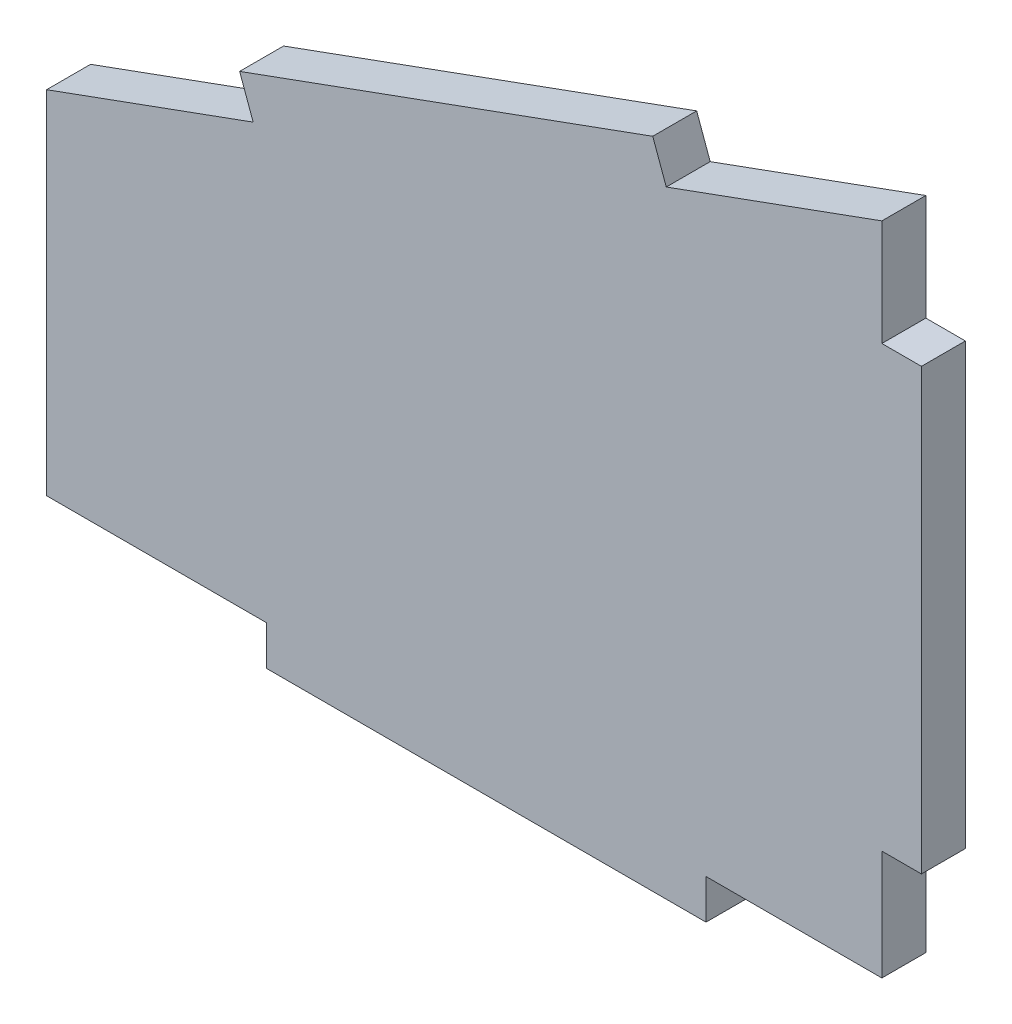
ISO-10303-21;
HEADER;
FILE_DESCRIPTION(('STEP AP214'),'2;1');
FILE_NAME('part.step','',(''),(''),'','','');
FILE_SCHEMA(('AUTOMOTIVE_DESIGN { 1 0 10303 214 1 1 1 1 }'));
ENDSEC;
DATA;
#1=APPLICATION_CONTEXT('core data for automotive mechanical design processes');
#2=APPLICATION_PROTOCOL_DEFINITION('international standard','automotive_design',2000,#1);
#3=PRODUCT_CONTEXT('',#1,'mechanical');
#4=PRODUCT('Part','Part','',(#3));
#5=PRODUCT_RELATED_PRODUCT_CATEGORY('part','',(#4));
#6=PRODUCT_DEFINITION_FORMATION('','',#4);
#7=PRODUCT_DEFINITION_CONTEXT('part definition',#1,'design');
#8=PRODUCT_DEFINITION('design','',#6,#7);
#9=PRODUCT_DEFINITION_SHAPE('','',#8);
#10=(LENGTH_UNIT() NAMED_UNIT(*) SI_UNIT(.MILLI.,.METRE.));
#11=(NAMED_UNIT(*) PLANE_ANGLE_UNIT() SI_UNIT($,.RADIAN.));
#12=(NAMED_UNIT(*) SI_UNIT($,.STERADIAN.) SOLID_ANGLE_UNIT());
#13=UNCERTAINTY_MEASURE_WITH_UNIT(LENGTH_MEASURE(1.E-05),#10,'distance_accuracy_value','');
#14=(GEOMETRIC_REPRESENTATION_CONTEXT(3) GLOBAL_UNCERTAINTY_ASSIGNED_CONTEXT((#13)) GLOBAL_UNIT_ASSIGNED_CONTEXT((#10,
#11,#12)) REPRESENTATION_CONTEXT('',''));
#15=CARTESIAN_POINT('',(0.,0.,0.));
#16=DIRECTION('',(0.,0.,1.));
#17=DIRECTION('',(1.,0.,0.));
#18=AXIS2_PLACEMENT_3D('',#15,#16,#17);
#19=CARTESIAN_POINT('',(99.5,-27.51,-0.01));
#20=DIRECTION('',(1.,0.,0.));
#21=DIRECTION('',(0.,1.,0.));
#22=AXIS2_PLACEMENT_3D('',#19,#20,#21);
#23=PLANE('',#22);
#24=DIRECTION('',(0.,1.,0.));
#25=VECTOR('',#24,1.);
#26=CARTESIAN_POINT('',(99.5,-4.9614138723554,5.));
#27=LINE('',#26,#25);
#28=CARTESIAN_POINT('',(99.5,-27.5,5.));
#29=VERTEX_POINT('',#28);
#30=CARTESIAN_POINT('',(99.5,22.5,5.));
#31=VERTEX_POINT('',#30);
#32=EDGE_CURVE('E266',#29,#31,#27,.T.);
#33=ORIENTED_EDGE('',*,*,#32,.F.);
#34=DIRECTION('',(0.,0.,1.));
#35=VECTOR('',#34,1.);
#36=CARTESIAN_POINT('',(99.5,-27.5,2.5));
#37=LINE('',#36,#35);
#38=CARTESIAN_POINT('',(99.5,-27.5,0.));
#39=VERTEX_POINT('',#38);
#40=EDGE_CURVE('E272',#39,#29,#37,.T.);
#41=ORIENTED_EDGE('',*,*,#40,.F.);
#42=DIRECTION('',(0.,-1.,0.));
#43=VECTOR('',#42,1.);
#44=CARTESIAN_POINT('',(99.5,-4.9614138723554,0.));
#45=LINE('',#44,#43);
#46=CARTESIAN_POINT('',(99.5,22.5,0.));
#47=VERTEX_POINT('',#46);
#48=EDGE_CURVE('E223',#47,#39,#45,.T.);
#49=ORIENTED_EDGE('',*,*,#48,.F.);
#50=DIRECTION('',(0.,0.,-1.));
#51=VECTOR('',#50,1.);
#52=CARTESIAN_POINT('',(99.5,22.5,2.5));
#53=LINE('',#52,#51);
#54=EDGE_CURVE('E219',#31,#47,#53,.T.);
#55=ORIENTED_EDGE('',*,*,#54,.F.);
#56=EDGE_LOOP('',(#33,#41,#49,#55));
#57=FACE_BOUND('',#56,.T.);
#58=ADVANCED_FACE('F16',(#57),#23,.T.);
#59=CARTESIAN_POINT('',(99.51,22.5,-0.01));
#60=DIRECTION('',(0.,1.,0.));
#61=DIRECTION('',(-1.,0.,0.));
#62=AXIS2_PLACEMENT_3D('',#59,#60,#61);
#63=PLANE('',#62);
#64=DIRECTION('',(-1.,0.,0.));
#65=VECTOR('',#64,1.);
#66=CARTESIAN_POINT('',(49.75,22.5,5.));
#67=LINE('',#66,#65);
#68=CARTESIAN_POINT('',(95.,22.5,5.));
#69=VERTEX_POINT('',#68);
#70=EDGE_CURVE('E179',#31,#69,#67,.T.);
#71=ORIENTED_EDGE('',*,*,#70,.F.);
#72=ORIENTED_EDGE('',*,*,#54,.T.);
#73=DIRECTION('',(1.,0.,0.));
#74=VECTOR('',#73,1.);
#75=CARTESIAN_POINT('',(49.75,22.5,0.));
#76=LINE('',#75,#74);
#77=CARTESIAN_POINT('',(95.,22.5,0.));
#78=VERTEX_POINT('',#77);
#79=EDGE_CURVE('E173',#78,#47,#76,.T.);
#80=ORIENTED_EDGE('',*,*,#79,.F.);
#81=DIRECTION('',(0.,0.,-1.));
#82=VECTOR('',#81,1.);
#83=CARTESIAN_POINT('',(95.,22.5,2.5));
#84=LINE('',#83,#82);
#85=EDGE_CURVE('E169',#69,#78,#84,.T.);
#86=ORIENTED_EDGE('',*,*,#85,.F.);
#87=EDGE_LOOP('',(#71,#72,#80,#86));
#88=FACE_BOUND('',#87,.T.);
#89=ADVANCED_FACE('F221',(#88),#63,.T.);
#90=CARTESIAN_POINT('',(95.,22.49,-0.01));
#91=DIRECTION('',(1.,0.,0.));
#92=DIRECTION('',(0.,1.,0.));
#93=AXIS2_PLACEMENT_3D('',#90,#91,#92);
#94=PLANE('',#93);
#95=DIRECTION('',(0.,1.,0.));
#96=VECTOR('',#95,1.);
#97=CARTESIAN_POINT('',(95.,-4.9614138723554,5.));
#98=LINE('',#97,#96);
#99=CARTESIAN_POINT('',(95.,34.5771722552892,5.));
#100=VERTEX_POINT('',#99);
#101=EDGE_CURVE('E175',#69,#100,#98,.T.);
#102=ORIENTED_EDGE('',*,*,#101,.F.);
#103=ORIENTED_EDGE('',*,*,#85,.T.);
#104=DIRECTION('',(0.,-1.,0.));
#105=VECTOR('',#104,1.);
#106=CARTESIAN_POINT('',(95.,-4.9614138723554,0.));
#107=LINE('',#106,#105);
#108=CARTESIAN_POINT('',(95.,34.5771722552892,0.));
#109=VERTEX_POINT('',#108);
#110=EDGE_CURVE('E170',#109,#78,#107,.T.);
#111=ORIENTED_EDGE('',*,*,#110,.F.);
#112=DIRECTION('',(0.,0.,-1.));
#113=VECTOR('',#112,1.);
#114=CARTESIAN_POINT('',(95.,34.5771722552892,2.5));
#115=LINE('',#114,#113);
#116=EDGE_CURVE('E167',#100,#109,#115,.T.);
#117=ORIENTED_EDGE('',*,*,#116,.F.);
#118=EDGE_LOOP('',(#102,#103,#111,#117));
#119=FACE_BOUND('',#118,.T.);
#120=ADVANCED_FACE('F215',(#119),#94,.T.);
#121=CARTESIAN_POINT('',(95.0093969262079,34.5805924567225,-0.01));
#122=DIRECTION('',(-0.342020143325668,0.939692620785909,0.));
#123=DIRECTION('',(-0.939692620785909,-0.342020143325668,0.));
#124=AXIS2_PLACEMENT_3D('',#121,#122,#123);
#125=PLANE('',#124);
#126=DIRECTION('',(-0.939692620785908,-0.34202014332567,0.));
#127=VECTOR('',#126,1.);
#128=CARTESIAN_POINT('',(95.,34.5771722552892,5.));
#129=LINE('',#128,#127);
#130=CARTESIAN_POINT('',(70.4769465589431,25.6515107494251,5.));
#131=VERTEX_POINT('',#130);
#132=EDGE_CURVE('E178',#100,#131,#129,.T.);
#133=ORIENTED_EDGE('',*,*,#132,.F.);
#134=ORIENTED_EDGE('',*,*,#116,.T.);
#135=DIRECTION('',(0.939692620785908,0.34202014332567,0.));
#136=VECTOR('',#135,1.);
#137=CARTESIAN_POINT('',(70.4769465589431,25.6515107494251,0.));
#138=LINE('',#137,#136);
#139=CARTESIAN_POINT('',(70.4769465589431,25.6515107494251,0.));
#140=VERTEX_POINT('',#139);
#141=EDGE_CURVE('E174',#140,#109,#138,.T.);
#142=ORIENTED_EDGE('',*,*,#141,.F.);
#143=DIRECTION('',(0.,0.,-1.));
#144=VECTOR('',#143,1.);
#145=CARTESIAN_POINT('',(70.4769465589431,25.6515107494251,2.5));
#146=LINE('',#145,#144);
#147=EDGE_CURVE('E165',#131,#140,#146,.T.);
#148=ORIENTED_EDGE('',*,*,#147,.F.);
#149=EDGE_LOOP('',(#133,#134,#142,#148));
#150=FACE_BOUND('',#149,.T.);
#151=ADVANCED_FACE('F210',(#150),#125,.T.);
#152=CARTESIAN_POINT('',(70.4803667603763,25.6421138232173,-0.01));
#153=DIRECTION('',(0.939692620785908,0.342020143325671,0.));
#154=DIRECTION('',(-0.342020143325671,0.939692620785908,0.));
#155=AXIS2_PLACEMENT_3D('',#152,#153,#154);
#156=PLANE('',#155);
#157=DIRECTION('',(-0.342020143325658,0.939692620785912,0.));
#158=VECTOR('',#157,1.);
#159=CARTESIAN_POINT('',(70.4769465589431,25.6515107494251,5.));
#160=LINE('',#159,#158);
#161=CARTESIAN_POINT('',(68.9378559139776,29.8801275429617,5.));
#162=VERTEX_POINT('',#161);
#163=EDGE_CURVE('E190',#131,#162,#160,.T.);
#164=ORIENTED_EDGE('',*,*,#163,.F.);
#165=ORIENTED_EDGE('',*,*,#147,.T.);
#166=DIRECTION('',(0.342020143325658,-0.939692620785912,0.));
#167=VECTOR('',#166,1.);
#168=CARTESIAN_POINT('',(68.9378559139776,29.8801275429617,0.));
#169=LINE('',#168,#167);
#170=CARTESIAN_POINT('',(68.9378559139776,29.8801275429617,0.));
#171=VERTEX_POINT('',#170);
#172=EDGE_CURVE('E197',#171,#140,#169,.T.);
#173=ORIENTED_EDGE('',*,*,#172,.F.);
#174=DIRECTION('',(0.,0.,-1.));
#175=VECTOR('',#174,1.);
#176=CARTESIAN_POINT('',(68.9378559139776,29.8801275429617,2.5));
#177=LINE('',#176,#175);
#178=EDGE_CURVE('E163',#162,#171,#177,.T.);
#179=ORIENTED_EDGE('',*,*,#178,.F.);
#180=EDGE_LOOP('',(#164,#165,#173,#179));
#181=FACE_BOUND('',#180,.T.);
#182=ADVANCED_FACE('F206',(#181),#156,.T.);
#183=CARTESIAN_POINT('',(68.9472528401855,29.883547744395,-0.01));
#184=DIRECTION('',(-0.342020143325669,0.939692620785908,0.));
#185=DIRECTION('',(-0.939692620785908,-0.342020143325669,0.));
#186=AXIS2_PLACEMENT_3D('',#183,#184,#185);
#187=PLANE('',#186);
#188=DIRECTION('',(-0.939692620785909,-0.342020143325668,0.));
#189=VECTOR('',#188,1.);
#190=CARTESIAN_POINT('',(68.9378559139776,29.8801275429617,5.));
#191=LINE('',#190,#189);
#192=CARTESIAN_POINT('',(21.9532248746822,12.7791203766783,5.));
#193=VERTEX_POINT('',#192);
#194=EDGE_CURVE('E187',#162,#193,#191,.T.);
#195=ORIENTED_EDGE('',*,*,#194,.F.);
#196=ORIENTED_EDGE('',*,*,#178,.T.);
#197=DIRECTION('',(0.939692620785909,0.342020143325668,0.));
#198=VECTOR('',#197,1.);
#199=CARTESIAN_POINT('',(21.9532248746822,12.7791203766783,0.));
#200=LINE('',#199,#198);
#201=CARTESIAN_POINT('',(21.9532248746822,12.7791203766783,0.));
#202=VERTEX_POINT('',#201);
#203=EDGE_CURVE('E150',#202,#171,#200,.T.);
#204=ORIENTED_EDGE('',*,*,#203,.F.);
#205=DIRECTION('',(0.,0.,-1.));
#206=VECTOR('',#205,1.);
#207=CARTESIAN_POINT('',(21.9532248746822,12.7791203766783,2.5));
#208=LINE('',#207,#206);
#209=EDGE_CURVE('E142',#193,#202,#208,.T.);
#210=ORIENTED_EDGE('',*,*,#209,.F.);
#211=EDGE_LOOP('',(#195,#196,#204,#210));
#212=FACE_BOUND('',#211,.T.);
#213=ADVANCED_FACE('F203',(#212),#187,.T.);
#214=CARTESIAN_POINT('',(21.9498046732489,12.7885173028862,-0.01));
#215=DIRECTION('',(-0.939692620785904,-0.342020143325682,0.));
#216=DIRECTION('',(0.342020143325682,-0.939692620785904,0.));
#217=AXIS2_PLACEMENT_3D('',#214,#215,#216);
#218=PLANE('',#217);
#219=DIRECTION('',(0.342020143325667,-0.939692620785909,0.));
#220=VECTOR('',#219,1.);
#221=CARTESIAN_POINT('',(21.9532248746822,12.7791203766783,5.));
#222=LINE('',#221,#220);
#223=CARTESIAN_POINT('',(23.4923155196477,8.55050358314172,5.));
#224=VERTEX_POINT('',#223);
#225=EDGE_CURVE('E185',#193,#224,#222,.T.);
#226=ORIENTED_EDGE('',*,*,#225,.F.);
#227=ORIENTED_EDGE('',*,*,#209,.T.);
#228=DIRECTION('',(-0.342020143325666,0.93969262078591,0.));
#229=VECTOR('',#228,1.);
#230=CARTESIAN_POINT('',(23.4923155196477,8.55050358314173,0.));
#231=LINE('',#230,#229);
#232=CARTESIAN_POINT('',(23.4923155196477,8.55050358314172,0.));
#233=VERTEX_POINT('',#232);
#234=EDGE_CURVE('E145',#233,#202,#231,.T.);
#235=ORIENTED_EDGE('',*,*,#234,.F.);
#236=DIRECTION('',(0.,0.,-1.));
#237=VECTOR('',#236,1.);
#238=CARTESIAN_POINT('',(23.4923155196477,8.55050358314171,2.5));
#239=LINE('',#238,#237);
#240=EDGE_CURVE('E132',#224,#233,#239,.T.);
#241=ORIENTED_EDGE('',*,*,#240,.F.);
#242=EDGE_LOOP('',(#226,#227,#235,#241));
#243=FACE_BOUND('',#242,.T.);
#244=ADVANCED_FACE('F146',(#243),#218,.T.);
#245=CARTESIAN_POINT('',(23.5017124458556,8.55392378457498,-0.01));
#246=DIRECTION('',(-0.342020143325668,0.939692620785908,0.));
#247=DIRECTION('',(-0.939692620785908,-0.342020143325668,0.));
#248=AXIS2_PLACEMENT_3D('',#245,#246,#247);
#249=PLANE('',#248);
#250=DIRECTION('',(-0.939692620785908,-0.34202014332567,0.));
#251=VECTOR('',#250,1.);
#252=CARTESIAN_POINT('',(23.4923155196477,8.55050358314173,5.));
#253=LINE('',#252,#251);
#254=CARTESIAN_POINT('',(0.,0.,5.));
#255=VERTEX_POINT('',#254);
#256=EDGE_CURVE('E138',#224,#255,#253,.T.);
#257=ORIENTED_EDGE('',*,*,#256,.F.);
#258=ORIENTED_EDGE('',*,*,#240,.T.);
#259=DIRECTION('',(0.939692620785908,0.342020143325669,0.));
#260=VECTOR('',#259,1.);
#261=CARTESIAN_POINT('',(0.,0.,0.));
#262=LINE('',#261,#260);
#263=CARTESIAN_POINT('',(0.,0.,0.));
#264=VERTEX_POINT('',#263);
#265=EDGE_CURVE('E20',#264,#233,#262,.T.);
#266=ORIENTED_EDGE('',*,*,#265,.F.);
#267=DIRECTION('',(0.,0.,-1.));
#268=VECTOR('',#267,1.);
#269=CARTESIAN_POINT('',(0.,0.,2.5));
#270=LINE('',#269,#268);
#271=EDGE_CURVE('E127',#255,#264,#270,.T.);
#272=ORIENTED_EDGE('',*,*,#271,.F.);
#273=EDGE_LOOP('',(#257,#258,#266,#272));
#274=FACE_BOUND('',#273,.T.);
#275=ADVANCED_FACE('F134',(#274),#249,.T.);
#276=CARTESIAN_POINT('',(0.,0.01,-0.01));
#277=DIRECTION('',(-1.,0.,0.));
#278=DIRECTION('',(0.,-1.,0.));
#279=AXIS2_PLACEMENT_3D('',#276,#277,#278);
#280=PLANE('',#279);
#281=DIRECTION('',(0.,-1.,0.));
#282=VECTOR('',#281,1.);
#283=CARTESIAN_POINT('',(0.,-4.9614138723554,5.));
#284=LINE('',#283,#282);
#285=CARTESIAN_POINT('',(0.,-40.,5.));
#286=VERTEX_POINT('',#285);
#287=EDGE_CURVE('E180',#255,#286,#284,.T.);
#288=ORIENTED_EDGE('',*,*,#287,.F.);
#289=ORIENTED_EDGE('',*,*,#271,.T.);
#290=DIRECTION('',(0.,1.,0.));
#291=VECTOR('',#290,1.);
#292=CARTESIAN_POINT('',(0.,-4.9614138723554,0.));
#293=LINE('',#292,#291);
#294=CARTESIAN_POINT('',(0.,-40.,0.));
#295=VERTEX_POINT('',#294);
#296=EDGE_CURVE('E154',#295,#264,#293,.T.);
#297=ORIENTED_EDGE('',*,*,#296,.F.);
#298=DIRECTION('',(0.,0.,-1.));
#299=VECTOR('',#298,1.);
#300=CARTESIAN_POINT('',(0.,-40.,2.5));
#301=LINE('',#300,#299);
#302=EDGE_CURVE('E243',#286,#295,#301,.T.);
#303=ORIENTED_EDGE('',*,*,#302,.F.);
#304=EDGE_LOOP('',(#288,#289,#297,#303));
#305=FACE_BOUND('',#304,.T.);
#306=ADVANCED_FACE('F249',(#305),#280,.T.);
#307=CARTESIAN_POINT('',(-0.01,-40.,-0.01));
#308=DIRECTION('',(0.,-1.,0.));
#309=DIRECTION('',(1.,0.,0.));
#310=AXIS2_PLACEMENT_3D('',#307,#308,#309);
#311=PLANE('',#310);
#312=DIRECTION('',(1.,0.,0.));
#313=VECTOR('',#312,1.);
#314=CARTESIAN_POINT('',(49.75,-40.,5.));
#315=LINE('',#314,#313);
#316=CARTESIAN_POINT('',(25.,-40.,5.));
#317=VERTEX_POINT('',#316);
#318=EDGE_CURVE('E183',#286,#317,#315,.T.);
#319=ORIENTED_EDGE('',*,*,#318,.F.);
#320=ORIENTED_EDGE('',*,*,#302,.T.);
#321=DIRECTION('',(-1.,0.,0.));
#322=VECTOR('',#321,1.);
#323=CARTESIAN_POINT('',(49.75,-40.,0.));
#324=LINE('',#323,#322);
#325=CARTESIAN_POINT('',(25.,-40.,0.));
#326=VERTEX_POINT('',#325);
#327=EDGE_CURVE('E155',#326,#295,#324,.T.);
#328=ORIENTED_EDGE('',*,*,#327,.F.);
#329=DIRECTION('',(0.,0.,-1.));
#330=VECTOR('',#329,1.);
#331=CARTESIAN_POINT('',(25.,-40.,2.5));
#332=LINE('',#331,#330);
#333=EDGE_CURVE('E241',#317,#326,#332,.T.);
#334=ORIENTED_EDGE('',*,*,#333,.F.);
#335=EDGE_LOOP('',(#319,#320,#328,#334));
#336=FACE_BOUND('',#335,.T.);
#337=ADVANCED_FACE('F247',(#336),#311,.T.);
#338=CARTESIAN_POINT('',(25.,-39.99,-0.01));
#339=DIRECTION('',(-1.,0.,0.));
#340=DIRECTION('',(0.,-1.,0.));
#341=AXIS2_PLACEMENT_3D('',#338,#339,#340);
#342=PLANE('',#341);
#343=DIRECTION('',(0.,-1.,0.));
#344=VECTOR('',#343,1.);
#345=CARTESIAN_POINT('',(25.,-4.9614138723554,5.));
#346=LINE('',#345,#344);
#347=CARTESIAN_POINT('',(25.,-44.5,5.));
#348=VERTEX_POINT('',#347);
#349=EDGE_CURVE('E257',#317,#348,#346,.T.);
#350=ORIENTED_EDGE('',*,*,#349,.F.);
#351=ORIENTED_EDGE('',*,*,#333,.T.);
#352=DIRECTION('',(0.,1.,0.));
#353=VECTOR('',#352,1.);
#354=CARTESIAN_POINT('',(25.,-4.9614138723554,0.));
#355=LINE('',#354,#353);
#356=CARTESIAN_POINT('',(25.,-44.5,0.));
#357=VERTEX_POINT('',#356);
#358=EDGE_CURVE('E157',#357,#326,#355,.T.);
#359=ORIENTED_EDGE('',*,*,#358,.F.);
#360=DIRECTION('',(0.,0.,-1.));
#361=VECTOR('',#360,1.);
#362=CARTESIAN_POINT('',(25.,-44.5,2.5));
#363=LINE('',#362,#361);
#364=EDGE_CURVE('E239',#348,#357,#363,.T.);
#365=ORIENTED_EDGE('',*,*,#364,.F.);
#366=EDGE_LOOP('',(#350,#351,#359,#365));
#367=FACE_BOUND('',#366,.T.);
#368=ADVANCED_FACE('F254',(#367),#342,.T.);
#369=CARTESIAN_POINT('',(24.99,-44.5,-0.01));
#370=DIRECTION('',(0.,-1.,0.));
#371=DIRECTION('',(1.,0.,0.));
#372=AXIS2_PLACEMENT_3D('',#369,#370,#371);
#373=PLANE('',#372);
#374=DIRECTION('',(1.,0.,0.));
#375=VECTOR('',#374,1.);
#376=CARTESIAN_POINT('',(49.75,-44.5,5.));
#377=LINE('',#376,#375);
#378=CARTESIAN_POINT('',(75.,-44.5,5.));
#379=VERTEX_POINT('',#378);
#380=EDGE_CURVE('E259',#348,#379,#377,.T.);
#381=ORIENTED_EDGE('',*,*,#380,.F.);
#382=ORIENTED_EDGE('',*,*,#364,.T.);
#383=DIRECTION('',(-1.,0.,0.));
#384=VECTOR('',#383,1.);
#385=CARTESIAN_POINT('',(49.75,-44.5,0.));
#386=LINE('',#385,#384);
#387=CARTESIAN_POINT('',(75.,-44.5,0.));
#388=VERTEX_POINT('',#387);
#389=EDGE_CURVE('E231',#388,#357,#386,.T.);
#390=ORIENTED_EDGE('',*,*,#389,.F.);
#391=DIRECTION('',(0.,0.,-1.));
#392=VECTOR('',#391,1.);
#393=CARTESIAN_POINT('',(75.,-44.5,2.5));
#394=LINE('',#393,#392);
#395=EDGE_CURVE('E237',#379,#388,#394,.T.);
#396=ORIENTED_EDGE('',*,*,#395,.F.);
#397=EDGE_LOOP('',(#381,#382,#390,#396));
#398=FACE_BOUND('',#397,.T.);
#399=ADVANCED_FACE('F302',(#398),#373,.T.);
#400=CARTESIAN_POINT('',(75.,-44.51,-0.01));
#401=DIRECTION('',(1.,0.,0.));
#402=DIRECTION('',(0.,1.,0.));
#403=AXIS2_PLACEMENT_3D('',#400,#401,#402);
#404=PLANE('',#403);
#405=DIRECTION('',(0.,1.,0.));
#406=VECTOR('',#405,1.);
#407=CARTESIAN_POINT('',(75.,-4.9614138723554,5.));
#408=LINE('',#407,#406);
#409=CARTESIAN_POINT('',(75.,-40.,5.));
#410=VERTEX_POINT('',#409);
#411=EDGE_CURVE('E298',#379,#410,#408,.T.);
#412=ORIENTED_EDGE('',*,*,#411,.F.);
#413=ORIENTED_EDGE('',*,*,#395,.T.);
#414=DIRECTION('',(0.,-1.,0.));
#415=VECTOR('',#414,1.);
#416=CARTESIAN_POINT('',(75.,-4.9614138723554,0.));
#417=LINE('',#416,#415);
#418=CARTESIAN_POINT('',(75.,-40.,0.));
#419=VERTEX_POINT('',#418);
#420=EDGE_CURVE('E234',#419,#388,#417,.T.);
#421=ORIENTED_EDGE('',*,*,#420,.F.);
#422=DIRECTION('',(0.,0.,-1.));
#423=VECTOR('',#422,1.);
#424=CARTESIAN_POINT('',(75.,-40.,2.5));
#425=LINE('',#424,#423);
#426=EDGE_CURVE('E290',#410,#419,#425,.T.);
#427=ORIENTED_EDGE('',*,*,#426,.F.);
#428=EDGE_LOOP('',(#412,#413,#421,#427));
#429=FACE_BOUND('',#428,.T.);
#430=ADVANCED_FACE('F304',(#429),#404,.T.);
#431=CARTESIAN_POINT('',(99.51,-44.51,0.));
#432=DIRECTION('',(0.,0.,-1.));
#433=DIRECTION('',(-1.,0.,0.));
#434=AXIS2_PLACEMENT_3D('',#431,#432,#433);
#435=PLANE('',#434);
#436=ORIENTED_EDGE('',*,*,#79,.T.);
#437=ORIENTED_EDGE('',*,*,#48,.T.);
#438=DIRECTION('',(1.,0.,0.));
#439=VECTOR('',#438,1.);
#440=CARTESIAN_POINT('',(97.25,-27.5,0.));
#441=LINE('',#440,#439);
#442=CARTESIAN_POINT('',(95.,-27.5,0.));
#443=VERTEX_POINT('',#442);
#444=EDGE_CURVE('E225',#443,#39,#441,.T.);
#445=ORIENTED_EDGE('',*,*,#444,.F.);
#446=DIRECTION('',(0.,1.,0.));
#447=VECTOR('',#446,1.);
#448=CARTESIAN_POINT('',(95.,-33.75,0.));
#449=LINE('',#448,#447);
#450=CARTESIAN_POINT('',(95.,-40.,0.));
#451=VERTEX_POINT('',#450);
#452=EDGE_CURVE('E283',#451,#443,#449,.T.);
#453=ORIENTED_EDGE('',*,*,#452,.F.);
#454=DIRECTION('',(1.,0.,0.));
#455=VECTOR('',#454,1.);
#456=CARTESIAN_POINT('',(85.,-40.,0.));
#457=LINE('',#456,#455);
#458=EDGE_CURVE('E296',#419,#451,#457,.T.);
#459=ORIENTED_EDGE('',*,*,#458,.F.);
#460=ORIENTED_EDGE('',*,*,#420,.T.);
#461=ORIENTED_EDGE('',*,*,#389,.T.);
#462=ORIENTED_EDGE('',*,*,#358,.T.);
#463=ORIENTED_EDGE('',*,*,#327,.T.);
#464=ORIENTED_EDGE('',*,*,#296,.T.);
#465=ORIENTED_EDGE('',*,*,#265,.T.);
#466=ORIENTED_EDGE('',*,*,#234,.T.);
#467=ORIENTED_EDGE('',*,*,#203,.T.);
#468=ORIENTED_EDGE('',*,*,#172,.T.);
#469=ORIENTED_EDGE('',*,*,#141,.T.);
#470=ORIENTED_EDGE('',*,*,#110,.T.);
#471=EDGE_LOOP('',(#436,#437,#445,#453,#459,#460,#461,#462,#463,#464,#465,#466,#467,#468,#469,#470));
#472=FACE_BOUND('',#471,.T.);
#473=ADVANCED_FACE('F152',(#472),#435,.T.);
#474=CARTESIAN_POINT('',(94.99,-27.5,-0.01));
#475=DIRECTION('',(0.,-1.,0.));
#476=DIRECTION('',(1.,0.,0.));
#477=AXIS2_PLACEMENT_3D('',#474,#475,#476);
#478=PLANE('',#477);
#479=DIRECTION('',(1.,0.,0.));
#480=VECTOR('',#479,1.);
#481=CARTESIAN_POINT('',(49.75,-27.5,5.));
#482=LINE('',#481,#480);
#483=CARTESIAN_POINT('',(95.,-27.5,5.));
#484=VERTEX_POINT('',#483);
#485=EDGE_CURVE('E269',#484,#29,#482,.T.);
#486=ORIENTED_EDGE('',*,*,#485,.F.);
#487=DIRECTION('',(0.,0.,1.));
#488=VECTOR('',#487,1.);
#489=CARTESIAN_POINT('',(95.,-27.5,2.5));
#490=LINE('',#489,#488);
#491=EDGE_CURVE('E280',#443,#484,#490,.T.);
#492=ORIENTED_EDGE('',*,*,#491,.F.);
#493=ORIENTED_EDGE('',*,*,#444,.T.);
#494=ORIENTED_EDGE('',*,*,#40,.T.);
#495=EDGE_LOOP('',(#486,#492,#493,#494));
#496=FACE_BOUND('',#495,.T.);
#497=ADVANCED_FACE('F276',(#496),#478,.T.);
#498=CARTESIAN_POINT('',(-0.0100000000000033,-44.51,5.));
#499=DIRECTION('',(0.,0.,1.));
#500=DIRECTION('',(1.,0.,0.));
#501=AXIS2_PLACEMENT_3D('',#498,#499,#500);
#502=PLANE('',#501);
#503=DIRECTION('',(-1.,0.,0.));
#504=VECTOR('',#503,1.);
#505=CARTESIAN_POINT('',(85.,-40.,5.));
#506=LINE('',#505,#504);
#507=CARTESIAN_POINT('',(95.,-40.,5.));
#508=VERTEX_POINT('',#507);
#509=EDGE_CURVE('E35',#508,#410,#506,.T.);
#510=ORIENTED_EDGE('',*,*,#509,.F.);
#511=DIRECTION('',(0.,-1.,0.));
#512=VECTOR('',#511,1.);
#513=CARTESIAN_POINT('',(95.,-33.75,5.));
#514=LINE('',#513,#512);
#515=EDGE_CURVE('E26',#484,#508,#514,.T.);
#516=ORIENTED_EDGE('',*,*,#515,.F.);
#517=ORIENTED_EDGE('',*,*,#485,.T.);
#518=ORIENTED_EDGE('',*,*,#32,.T.);
#519=ORIENTED_EDGE('',*,*,#70,.T.);
#520=ORIENTED_EDGE('',*,*,#101,.T.);
#521=ORIENTED_EDGE('',*,*,#132,.T.);
#522=ORIENTED_EDGE('',*,*,#163,.T.);
#523=ORIENTED_EDGE('',*,*,#194,.T.);
#524=ORIENTED_EDGE('',*,*,#225,.T.);
#525=ORIENTED_EDGE('',*,*,#256,.T.);
#526=ORIENTED_EDGE('',*,*,#287,.T.);
#527=ORIENTED_EDGE('',*,*,#318,.T.);
#528=ORIENTED_EDGE('',*,*,#349,.T.);
#529=ORIENTED_EDGE('',*,*,#380,.T.);
#530=ORIENTED_EDGE('',*,*,#411,.T.);
#531=EDGE_LOOP('',(#510,#516,#517,#518,#519,#520,#521,#522,#523,#524,#525,#526,#527,#528,#529,#530));
#532=FACE_BOUND('',#531,.T.);
#533=ADVANCED_FACE('F261',(#532),#502,.T.);
#534=CARTESIAN_POINT('',(74.99,-40.,-0.01));
#535=DIRECTION('',(0.,-1.,0.));
#536=DIRECTION('',(1.,0.,0.));
#537=AXIS2_PLACEMENT_3D('',#534,#535,#536);
#538=PLANE('',#537);
#539=ORIENTED_EDGE('',*,*,#509,.T.);
#540=ORIENTED_EDGE('',*,*,#426,.T.);
#541=ORIENTED_EDGE('',*,*,#458,.T.);
#542=DIRECTION('',(0.,0.,-1.));
#543=VECTOR('',#542,1.);
#544=CARTESIAN_POINT('',(95.,-40.,2.5));
#545=LINE('',#544,#543);
#546=EDGE_CURVE('E11',#508,#451,#545,.T.);
#547=ORIENTED_EDGE('',*,*,#546,.F.);
#548=EDGE_LOOP('',(#539,#540,#541,#547));
#549=FACE_BOUND('',#548,.T.);
#550=ADVANCED_FACE('F306',(#549),#538,.T.);
#551=CARTESIAN_POINT('',(95.,-40.01,-0.01));
#552=DIRECTION('',(1.,0.,0.));
#553=DIRECTION('',(0.,1.,0.));
#554=AXIS2_PLACEMENT_3D('',#551,#552,#553);
#555=PLANE('',#554);
#556=ORIENTED_EDGE('',*,*,#515,.T.);
#557=ORIENTED_EDGE('',*,*,#546,.T.);
#558=ORIENTED_EDGE('',*,*,#452,.T.);
#559=ORIENTED_EDGE('',*,*,#491,.T.);
#560=EDGE_LOOP('',(#556,#557,#558,#559));
#561=FACE_BOUND('',#560,.T.);
#562=ADVANCED_FACE('F18',(#561),#555,.T.);
#563=CLOSED_SHELL('',(#58,#89,#120,#151,#182,#213,#244,#275,#306,#337,#368,#399,#430,#473,#497,
#533,#550,#562));
#564=MANIFOLD_SOLID_BREP('B1',#563);
#565=ADVANCED_BREP_SHAPE_REPRESENTATION('',(#18,#564),#14);
#566=SHAPE_DEFINITION_REPRESENTATION(#9,#565);
ENDSEC;
END-ISO-10303-21;
